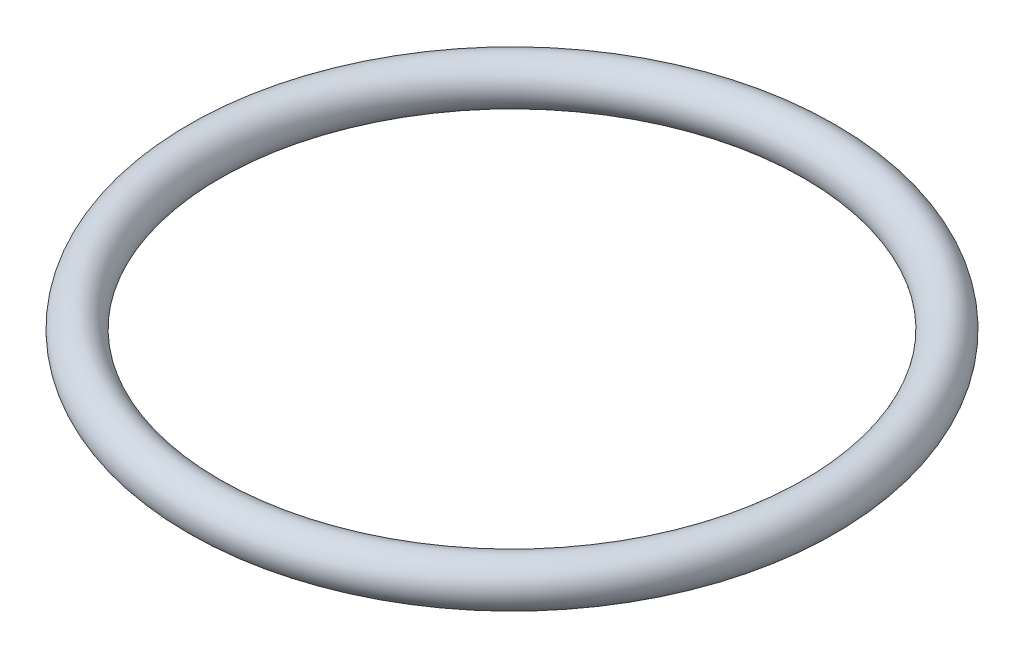
ISO-10303-21;
HEADER;
FILE_DESCRIPTION(('STEP AP214'),'2;1');
FILE_NAME('part.step','',(''),(''),'','','');
FILE_SCHEMA(('AUTOMOTIVE_DESIGN { 1 0 10303 214 1 1 1 1 }'));
ENDSEC;
DATA;
#1=APPLICATION_CONTEXT('core data for automotive mechanical design processes');
#2=APPLICATION_PROTOCOL_DEFINITION('international standard','automotive_design',2000,#1);
#3=PRODUCT_CONTEXT('',#1,'mechanical');
#4=PRODUCT('Part','Part','',(#3));
#5=PRODUCT_RELATED_PRODUCT_CATEGORY('part','',(#4));
#6=PRODUCT_DEFINITION_FORMATION('','',#4);
#7=PRODUCT_DEFINITION_CONTEXT('part definition',#1,'design');
#8=PRODUCT_DEFINITION('design','',#6,#7);
#9=PRODUCT_DEFINITION_SHAPE('','',#8);
#10=(LENGTH_UNIT() NAMED_UNIT(*) SI_UNIT(.MILLI.,.METRE.));
#11=(NAMED_UNIT(*) PLANE_ANGLE_UNIT() SI_UNIT($,.RADIAN.));
#12=(NAMED_UNIT(*) SI_UNIT($,.STERADIAN.) SOLID_ANGLE_UNIT());
#13=UNCERTAINTY_MEASURE_WITH_UNIT(LENGTH_MEASURE(1.E-05),#10,'distance_accuracy_value','');
#14=(GEOMETRIC_REPRESENTATION_CONTEXT(3) GLOBAL_UNCERTAINTY_ASSIGNED_CONTEXT((#13)) GLOBAL_UNIT_ASSIGNED_CONTEXT((#10,
#11,#12)) REPRESENTATION_CONTEXT('',''));
#15=CARTESIAN_POINT('',(0.,0.,0.));
#16=DIRECTION('',(0.,0.,1.));
#17=DIRECTION('',(1.,0.,0.));
#18=AXIS2_PLACEMENT_3D('',#15,#16,#17);
#19=CARTESIAN_POINT('',(0.,0.,0.));
#20=DIRECTION('',(0.,1.,0.));
#21=DIRECTION('',(0.,0.,1.));
#22=AXIS2_PLACEMENT_3D('',#19,#20,#21);
#23=TOROIDAL_SURFACE('',#22,44.45,3.175);
#24=CARTESIAN_POINT('',(0.,0.,-44.45));
#25=DIRECTION('',(1.,0.,0.));
#26=DIRECTION('',(0.,0.,-1.));
#27=AXIS2_PLACEMENT_3D('',#24,#25,#26);
#28=CIRCLE('',#27,3.175);
#29=CARTESIAN_POINT('',(0.,0.,-47.625));
#30=VERTEX_POINT('',#29);
#31=EDGE_CURVE('E10',#30,#30,#28,.T.);
#32=CARTESIAN_POINT('',(0.,0.,0.));
#33=DIRECTION('',(0.,1.,0.));
#34=DIRECTION('',(0.,0.,1.));
#35=AXIS2_PLACEMENT_3D('',#32,#33,#34);
#36=CIRCLE('',#35,47.625);
#37=EDGE_CURVE('',#30,#30,#36,.T.);
#38=ORIENTED_EDGE('',*,*,#31,.F.);
#39=ORIENTED_EDGE('',*,*,#31,.T.);
#40=ORIENTED_EDGE('',*,*,#37,.T.);
#41=ORIENTED_EDGE('',*,*,#37,.F.);
#42=EDGE_LOOP('',(#38,#40,#39,#41));
#43=FACE_BOUND('',#42,.T.);
#44=ADVANCED_FACE('F38',(#43),#23,.T.);
#45=CLOSED_SHELL('',(#44));
#46=MANIFOLD_SOLID_BREP('B2',#45);
#47=ADVANCED_BREP_SHAPE_REPRESENTATION('',(#18,#46),#14);
#48=SHAPE_DEFINITION_REPRESENTATION(#9,#47);
ENDSEC;
END-ISO-10303-21;
